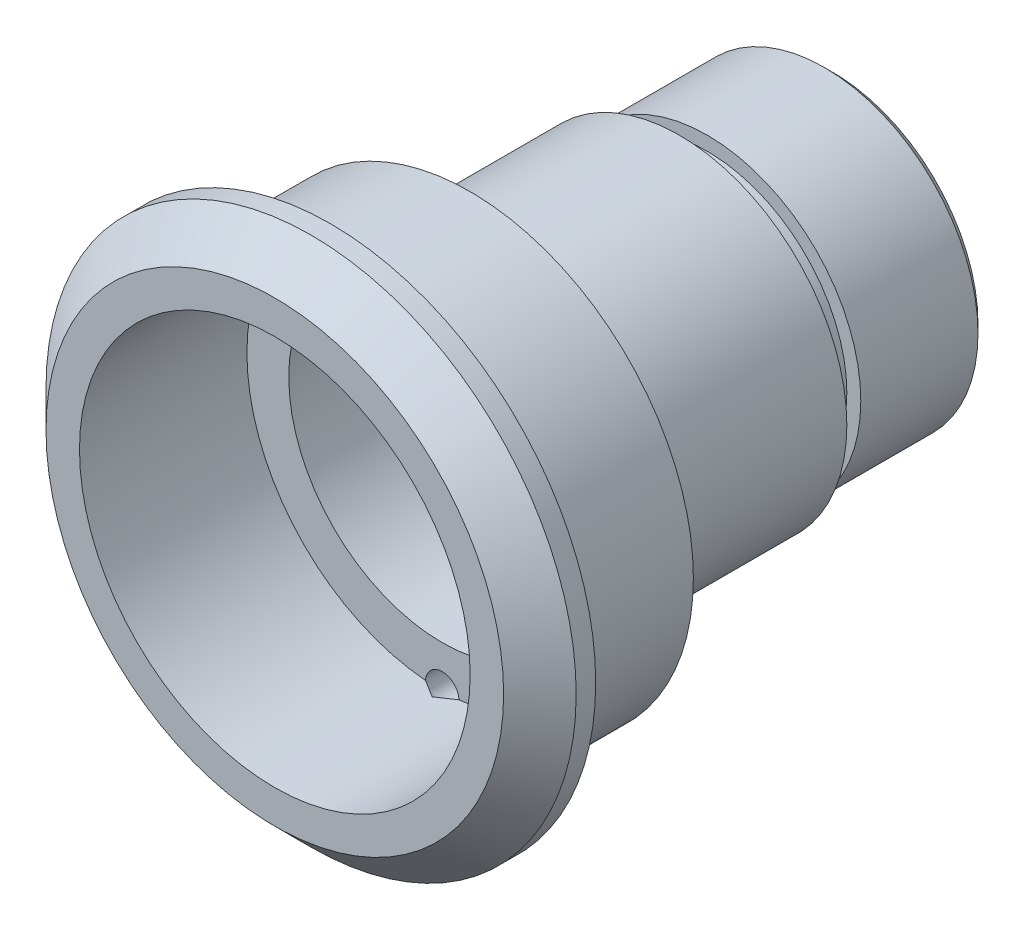
ISO-10303-21;
HEADER;
FILE_DESCRIPTION(('STEP AP214'),'2;1');
FILE_NAME('part.step','',(''),(''),'','','');
FILE_SCHEMA(('AUTOMOTIVE_DESIGN { 1 0 10303 214 1 1 1 1 }'));
ENDSEC;
DATA;
#1=APPLICATION_CONTEXT('core data for automotive mechanical design processes');
#2=APPLICATION_PROTOCOL_DEFINITION('international standard','automotive_design',2000,#1);
#3=PRODUCT_CONTEXT('',#1,'mechanical');
#4=PRODUCT('Part','Part','',(#3));
#5=PRODUCT_RELATED_PRODUCT_CATEGORY('part','',(#4));
#6=PRODUCT_DEFINITION_FORMATION('','',#4);
#7=PRODUCT_DEFINITION_CONTEXT('part definition',#1,'design');
#8=PRODUCT_DEFINITION('design','',#6,#7);
#9=PRODUCT_DEFINITION_SHAPE('','',#8);
#10=(LENGTH_UNIT() NAMED_UNIT(*) SI_UNIT(.MILLI.,.METRE.));
#11=(NAMED_UNIT(*) PLANE_ANGLE_UNIT() SI_UNIT($,.RADIAN.));
#12=(NAMED_UNIT(*) SI_UNIT($,.STERADIAN.) SOLID_ANGLE_UNIT());
#13=UNCERTAINTY_MEASURE_WITH_UNIT(LENGTH_MEASURE(1.E-05),#10,'distance_accuracy_value','');
#14=(GEOMETRIC_REPRESENTATION_CONTEXT(3) GLOBAL_UNCERTAINTY_ASSIGNED_CONTEXT((#13)) GLOBAL_UNIT_ASSIGNED_CONTEXT((#10,
#11,#12)) REPRESENTATION_CONTEXT('',''));
#15=CARTESIAN_POINT('',(0.,0.,0.));
#16=DIRECTION('',(0.,0.,1.));
#17=DIRECTION('',(1.,0.,0.));
#18=AXIS2_PLACEMENT_3D('',#15,#16,#17);
#19=CARTESIAN_POINT('',(0.,0.,-7.));
#20=DIRECTION('',(0.,0.,1.));
#21=DIRECTION('',(1.,0.,0.));
#22=AXIS2_PLACEMENT_3D('',#19,#20,#21);
#23=PLANE('',#22);
#24=CARTESIAN_POINT('',(0.,0.,-7.));
#25=DIRECTION('',(0.,0.,1.));
#26=DIRECTION('',(1.,0.,0.));
#27=AXIS2_PLACEMENT_3D('',#24,#25,#26);
#28=CIRCLE('',#27,8.);
#29=CARTESIAN_POINT('',(8.,0.,-7.));
#30=VERTEX_POINT('',#29);
#31=EDGE_CURVE('E173',#30,#30,#28,.F.);
#32=ORIENTED_EDGE('',*,*,#31,.T.);
#33=EDGE_LOOP('',(#32));
#34=FACE_BOUND('',#33,.T.);
#35=CARTESIAN_POINT('',(0.,-7.,-7.));
#36=DIRECTION('',(0.,0.,-1.));
#37=DIRECTION('',(-1.,0.,0.));
#38=AXIS2_PLACEMENT_3D('',#35,#36,#37);
#39=CIRCLE('',#38,0.599999999999989);
#40=CARTESIAN_POINT('',(0.499712046826593,-6.66790382378539,-7.));
#41=VERTEX_POINT('',#40);
#42=CARTESIAN_POINT('',(-0.49971204682659,-6.66790382378539,-7.));
#43=VERTEX_POINT('',#42);
#44=EDGE_CURVE('E76',#41,#43,#39,.T.);
#45=ORIENTED_EDGE('',*,*,#44,.F.);
#46=CARTESIAN_POINT('',(0.,0.,-7.));
#47=DIRECTION('',(0.,0.,1.));
#48=DIRECTION('',(1.,0.,0.));
#49=AXIS2_PLACEMENT_3D('',#46,#47,#48);
#50=CIRCLE('',#49,6.68660254037844);
#51=CARTESIAN_POINT('',(0.49971204682659,6.66790382378539,-7.));
#52=VERTEX_POINT('',#51);
#53=EDGE_CURVE('E157',#41,#52,#50,.T.);
#54=ORIENTED_EDGE('',*,*,#53,.T.);
#55=CARTESIAN_POINT('',(0.,7.,-7.));
#56=DIRECTION('',(0.,0.,-1.));
#57=DIRECTION('',(-1.,0.,0.));
#58=AXIS2_PLACEMENT_3D('',#55,#56,#57);
#59=CIRCLE('',#58,0.599999999999989);
#60=CARTESIAN_POINT('',(-0.499712046826593,6.66790382378539,-7.));
#61=VERTEX_POINT('',#60);
#62=EDGE_CURVE('E118',#61,#52,#59,.T.);
#63=ORIENTED_EDGE('',*,*,#62,.F.);
#64=EDGE_CURVE('E162',#61,#43,#50,.T.);
#65=ORIENTED_EDGE('',*,*,#64,.T.);
#66=EDGE_LOOP('',(#45,#54,#63,#65));
#67=FACE_BOUND('',#66,.T.);
#68=ADVANCED_FACE('F57',(#34,#67),#23,.F.);
#69=CARTESIAN_POINT('',(0.,0.,-20.));
#70=DIRECTION('',(0.,0.,1.));
#71=DIRECTION('',(1.,0.,0.));
#72=AXIS2_PLACEMENT_3D('',#69,#70,#71);
#73=CYLINDRICAL_SURFACE('',#72,4.05);
#74=CARTESIAN_POINT('',(0.,0.,-14.7));
#75=DIRECTION('',(0.,0.,1.));
#76=DIRECTION('',(1.,0.,0.));
#77=AXIS2_PLACEMENT_3D('',#74,#75,#76);
#78=CIRCLE('',#77,4.05);
#79=CARTESIAN_POINT('',(4.05,0.,-14.7));
#80=VERTEX_POINT('',#79);
#81=EDGE_CURVE('E192',#80,#80,#78,.T.);
#82=ORIENTED_EDGE('',*,*,#81,.T.);
#83=EDGE_LOOP('',(#82));
#84=FACE_BOUND('',#83,.T.);
#85=CARTESIAN_POINT('',(0.,0.,-15.3));
#86=DIRECTION('',(0.,0.,1.));
#87=DIRECTION('',(1.,0.,0.));
#88=AXIS2_PLACEMENT_3D('',#85,#86,#87);
#89=CIRCLE('',#88,4.05);
#90=CARTESIAN_POINT('',(4.05,0.,-15.3));
#91=VERTEX_POINT('',#90);
#92=EDGE_CURVE('E144',#91,#91,#89,.F.);
#93=ORIENTED_EDGE('',*,*,#92,.T.);
#94=EDGE_LOOP('',(#93));
#95=FACE_BOUND('',#94,.T.);
#96=ADVANCED_FACE('F255',(#84,#95),#73,.F.);
#97=CARTESIAN_POINT('',(0.,0.,31.1224482097295));
#98=DIRECTION('',(0.,0.,-1.));
#99=DIRECTION('',(-1.,0.,0.));
#100=AXIS2_PLACEMENT_3D('',#97,#98,#99);
#101=CYLINDRICAL_SURFACE('',#100,6.);
#102=CARTESIAN_POINT('',(0.,0.,-14.5));
#103=DIRECTION('',(0.,0.,1.));
#104=DIRECTION('',(1.,0.,0.));
#105=AXIS2_PLACEMENT_3D('',#102,#103,#104);
#106=CIRCLE('',#105,6.);
#107=CARTESIAN_POINT('',(6.,0.,-14.5));
#108=VERTEX_POINT('',#107);
#109=EDGE_CURVE('E168',#108,#108,#106,.F.);
#110=ORIENTED_EDGE('',*,*,#109,.F.);
#111=EDGE_LOOP('',(#110));
#112=FACE_BOUND('',#111,.T.);
#113=CARTESIAN_POINT('',(0.,0.,-6.95));
#114=DIRECTION('',(0.,0.,1.));
#115=DIRECTION('',(1.,0.,0.));
#116=AXIS2_PLACEMENT_3D('',#113,#114,#115);
#117=CIRCLE('',#116,6.);
#118=CARTESIAN_POINT('',(6.,0.,-6.95));
#119=VERTEX_POINT('',#118);
#120=EDGE_CURVE('E148',#119,#119,#117,.T.);
#121=ORIENTED_EDGE('',*,*,#120,.F.);
#122=EDGE_LOOP('',(#121));
#123=FACE_BOUND('',#122,.T.);
#124=ADVANCED_FACE('F261',(#112,#123),#101,.T.);
#125=CARTESIAN_POINT('',(0.,0.,-14.5));
#126=DIRECTION('',(0.,0.,1.));
#127=DIRECTION('',(1.,0.,0.));
#128=AXIS2_PLACEMENT_3D('',#125,#126,#127);
#129=PLANE('',#128);
#130=ORIENTED_EDGE('',*,*,#109,.T.);
#131=EDGE_LOOP('',(#130));
#132=FACE_BOUND('',#131,.T.);
#133=CARTESIAN_POINT('',(0.,0.,-14.5));
#134=DIRECTION('',(0.,0.,1.));
#135=DIRECTION('',(1.,0.,0.));
#136=AXIS2_PLACEMENT_3D('',#133,#134,#135);
#137=CIRCLE('',#136,5.);
#138=CARTESIAN_POINT('',(5.,0.,-14.5));
#139=VERTEX_POINT('',#138);
#140=EDGE_CURVE('E165',#139,#139,#137,.T.);
#141=ORIENTED_EDGE('',*,*,#140,.T.);
#142=EDGE_LOOP('',(#141));
#143=FACE_BOUND('',#142,.T.);
#144=ADVANCED_FACE('F457',(#132,#143),#129,.F.);
#145=CARTESIAN_POINT('',(0.,0.,0.));
#146=DIRECTION('',(0.,0.,1.));
#147=DIRECTION('',(1.,0.,0.));
#148=AXIS2_PLACEMENT_3D('',#145,#146,#147);
#149=CYLINDRICAL_SURFACE('',#148,5.);
#150=CARTESIAN_POINT('',(0.,0.,-15.5));
#151=DIRECTION('',(0.,0.,1.));
#152=DIRECTION('',(1.,0.,0.));
#153=AXIS2_PLACEMENT_3D('',#150,#151,#152);
#154=CIRCLE('',#153,5.);
#155=CARTESIAN_POINT('',(5.,0.,-15.5));
#156=VERTEX_POINT('',#155);
#157=EDGE_CURVE('E161',#156,#156,#154,.T.);
#158=ORIENTED_EDGE('',*,*,#157,.T.);
#159=EDGE_LOOP('',(#158));
#160=FACE_BOUND('',#159,.T.);
#161=ORIENTED_EDGE('',*,*,#140,.F.);
#162=EDGE_LOOP('',(#161));
#163=FACE_BOUND('',#162,.T.);
#164=ADVANCED_FACE('F473',(#160,#163),#149,.T.);
#165=CARTESIAN_POINT('',(0.,5.5,-15.5));
#166=DIRECTION('',(0.,0.,1.));
#167=DIRECTION('',(1.,0.,0.));
#168=AXIS2_PLACEMENT_3D('',#165,#166,#167);
#169=PLANE('',#168);
#170=CARTESIAN_POINT('',(0.,0.,-15.5));
#171=DIRECTION('',(0.,0.,1.));
#172=DIRECTION('',(1.,0.,0.));
#173=AXIS2_PLACEMENT_3D('',#170,#171,#172);
#174=CIRCLE('',#173,5.5);
#175=CARTESIAN_POINT('',(5.5,0.,-15.5));
#176=VERTEX_POINT('',#175);
#177=EDGE_CURVE('E158',#176,#176,#174,.T.);
#178=ORIENTED_EDGE('',*,*,#177,.T.);
#179=EDGE_LOOP('',(#178));
#180=FACE_BOUND('',#179,.T.);
#181=ORIENTED_EDGE('',*,*,#157,.F.);
#182=EDGE_LOOP('',(#181));
#183=FACE_BOUND('',#182,.T.);
#184=ADVANCED_FACE('F282',(#180,#183),#169,.T.);
#185=CARTESIAN_POINT('',(0.,0.,-20.));
#186=DIRECTION('',(0.,0.,1.));
#187=DIRECTION('',(1.,0.,0.));
#188=AXIS2_PLACEMENT_3D('',#185,#186,#187);
#189=PLANE('',#188);
#190=CARTESIAN_POINT('',(0.,0.,-20.));
#191=DIRECTION('',(0.,0.,-1.));
#192=DIRECTION('',(-1.,0.,0.));
#193=AXIS2_PLACEMENT_3D('',#190,#191,#192);
#194=CIRCLE('',#193,4.5);
#195=CARTESIAN_POINT('',(-4.5,0.,-20.));
#196=VERTEX_POINT('',#195);
#197=EDGE_CURVE('E149',#196,#196,#194,.T.);
#198=ORIENTED_EDGE('',*,*,#197,.F.);
#199=EDGE_LOOP('',(#198));
#200=FACE_BOUND('',#199,.T.);
#201=CARTESIAN_POINT('',(0.,0.,-20.));
#202=DIRECTION('',(0.,0.,1.));
#203=DIRECTION('',(1.,0.,0.));
#204=AXIS2_PLACEMENT_3D('',#201,#202,#203);
#205=CIRCLE('',#204,5.2);
#206=CARTESIAN_POINT('',(5.2,0.,-20.));
#207=VERTEX_POINT('',#206);
#208=EDGE_CURVE('E176',#207,#207,#205,.F.);
#209=ORIENTED_EDGE('',*,*,#208,.T.);
#210=EDGE_LOOP('',(#209));
#211=FACE_BOUND('',#210,.T.);
#212=ADVANCED_FACE('F278',(#200,#211),#189,.F.);
#213=CARTESIAN_POINT('',(0.,0.,21.1360399199047));
#214=DIRECTION('',(0.,0.,-1.));
#215=DIRECTION('',(-1.,0.,0.));
#216=AXIS2_PLACEMENT_3D('',#213,#214,#215);
#217=CYLINDRICAL_SURFACE('',#216,5.5);
#218=CARTESIAN_POINT('',(0.,0.,-19.7));
#219=DIRECTION('',(0.,0.,1.));
#220=DIRECTION('',(1.,0.,0.));
#221=AXIS2_PLACEMENT_3D('',#218,#219,#220);
#222=CIRCLE('',#221,5.5);
#223=CARTESIAN_POINT('',(5.5,0.,-19.7));
#224=VERTEX_POINT('',#223);
#225=EDGE_CURVE('E183',#224,#224,#222,.T.);
#226=ORIENTED_EDGE('',*,*,#225,.T.);
#227=EDGE_LOOP('',(#226));
#228=FACE_BOUND('',#227,.T.);
#229=ORIENTED_EDGE('',*,*,#177,.F.);
#230=EDGE_LOOP('',(#229));
#231=FACE_BOUND('',#230,.T.);
#232=ADVANCED_FACE('F281',(#228,#231),#217,.T.);
#233=CARTESIAN_POINT('',(0.,0.,-20.));
#234=DIRECTION('',(0.,0.,1.));
#235=DIRECTION('',(1.,0.,0.));
#236=AXIS2_PLACEMENT_3D('',#233,#234,#235);
#237=CONICAL_SURFACE('',#236,5.2,0.78539816339744);
#238=ORIENTED_EDGE('',*,*,#225,.F.);
#239=EDGE_LOOP('',(#238));
#240=FACE_BOUND('',#239,.T.);
#241=ORIENTED_EDGE('',*,*,#208,.F.);
#242=EDGE_LOOP('',(#241));
#243=FACE_BOUND('',#242,.T.);
#244=ADVANCED_FACE('F293',(#240,#243),#237,.T.);
#245=CARTESIAN_POINT('',(0.,0.,-6.77679491924311));
#246=DIRECTION('',(0.,0.,-1.));
#247=DIRECTION('',(-1.,0.,0.));
#248=AXIS2_PLACEMENT_3D('',#245,#246,#247);
#249=CONICAL_SURFACE('',#248,6.3,1.04719755119659);
#250=CARTESIAN_POINT('',(0.,0.,-6.77679491924311));
#251=DIRECTION('',(0.,0.,1.));
#252=DIRECTION('',(1.,0.,0.));
#253=AXIS2_PLACEMENT_3D('',#250,#251,#252);
#254=CIRCLE('',#253,6.3);
#255=CARTESIAN_POINT('',(6.3,0.,-6.77679491924311));
#256=VERTEX_POINT('',#255);
#257=EDGE_CURVE('E154',#256,#256,#254,.T.);
#258=ORIENTED_EDGE('',*,*,#257,.T.);
#259=EDGE_LOOP('',(#258));
#260=FACE_BOUND('',#259,.T.);
#261=ORIENTED_EDGE('',*,*,#53,.F.);
#262=CARTESIAN_POINT('',(0.499931803204619,-6.66823473336625,-7.0002));
#263=CARTESIAN_POINT('',(0.481868871640982,-6.64098917877085,-6.98373710964591));
#264=CARTESIAN_POINT('',(0.46134061995718,-6.6149179000884,-6.96787100584774));
#265=CARTESIAN_POINT('',(0.415486066946909,-6.56582941066476,-6.93783310115662));
#266=CARTESIAN_POINT('',(0.39012529686623,-6.54283629453614,-6.92367474442129));
#267=CARTESIAN_POINT('',(0.334893479556244,-6.50094835648245,-6.89775864719696));
#268=CARTESIAN_POINT('',(0.305003020703138,-6.48207206977728,-6.8860117773339));
#269=CARTESIAN_POINT('',(0.241566147061567,-6.44962919975067,-6.86575164458902));
#270=CARTESIAN_POINT('',(0.208032130434367,-6.43604528920643,-6.85722783217549));
#271=CARTESIAN_POINT('',(0.142547018702538,-6.41629927479261,-6.84481288119898));
#272=CARTESIAN_POINT('',(0.110887598519857,-6.40944297763231,-6.84048907141598));
#273=CARTESIAN_POINT('',(0.0465919619470222,-6.40093515438383,-6.83512146778807));
#274=CARTESIAN_POINT('',(0.0139559167056153,-6.39928272167395,-6.8340771025956));
#275=CARTESIAN_POINT('',(-0.0475402773049551,-6.40118232283446,-6.83527645712868));
#276=CARTESIAN_POINT('',(-0.0764262030368063,-6.40418955313425,-6.83717598469158));
#277=CARTESIAN_POINT('',(-0.133181626885946,-6.41425868846028,-6.84352437752356));
#278=CARTESIAN_POINT('',(-0.161051352670028,-6.42131967928247,-6.84797266799518));
#279=CARTESIAN_POINT('',(-0.215168582467526,-6.43918105578991,-6.85919379099335));
#280=CARTESIAN_POINT('',(-0.241410101092658,-6.44999437422474,-6.865974662267));
#281=CARTESIAN_POINT('',(-0.291647128680451,-6.47490098404804,-6.8815373399178));
#282=CARTESIAN_POINT('',(-0.315641377798312,-6.48899609999757,-6.8903202593043));
#283=CARTESIAN_POINT('',(-0.363287394640745,-6.52152761112996,-6.91050584073616));
#284=CARTESIAN_POINT('',(-0.386664007044726,-6.54025746795904,-6.92208280936149));
#285=CARTESIAN_POINT('',(-0.429941710925007,-6.58045014533174,-6.9467951117563));
#286=CARTESIAN_POINT('',(-0.449844462140309,-6.60191165222702,-6.95992969626356));
#287=CARTESIAN_POINT('',(-0.479325792853137,-6.6386434752432,-6.98228398441422));
#288=CARTESIAN_POINT('',(-0.489997114067349,-6.65326092447222,-6.991150758366));
#289=CARTESIAN_POINT('',(-0.499931803204624,-6.66823473336625,-7.0002));
#290=B_SPLINE_CURVE_WITH_KNOTS('',3,(#262,#263,#264,#265,#266,#267,#268,#269,#270,#271,#272,
#273,#274,#275,#276,#277,#278,#279,#280,#281,#282,#283,#284,#285,#286,#287,#288,#289),
.UNSPECIFIED.,.F.,.F.,(4,2,2,2,2,2,2,2,2,2,2,2,2,4),(0.,0.109813049369391,0.220440848941089,
0.331556891855849,0.442306021148065,0.539786934900109,0.63725086450438,0.724148569795621,
0.811026685610627,0.898207258910785,0.985436417693035,1.08140484522836,1.17732729477037,
1.23770379450551),.UNSPECIFIED.);
#291=EDGE_CURVE('E15',#41,#43,#290,.T.);
#292=ORIENTED_EDGE('',*,*,#291,.T.);
#293=ORIENTED_EDGE('',*,*,#64,.F.);
#294=CARTESIAN_POINT('',(-0.499931803204619,6.66823473336625,-7.0002));
#295=CARTESIAN_POINT('',(-0.481868871640982,6.64098917877085,-6.98373710964591));
#296=CARTESIAN_POINT('',(-0.46134061995718,6.6149179000884,-6.96787100584774));
#297=CARTESIAN_POINT('',(-0.415486066946909,6.56582941066476,-6.93783310115662));
#298=CARTESIAN_POINT('',(-0.39012529686623,6.54283629453614,-6.92367474442129));
#299=CARTESIAN_POINT('',(-0.334893479556244,6.50094835648245,-6.89775864719696));
#300=CARTESIAN_POINT('',(-0.305003020703138,6.48207206977728,-6.8860117773339));
#301=CARTESIAN_POINT('',(-0.241566147061567,6.44962919975067,-6.86575164458902));
#302=CARTESIAN_POINT('',(-0.208032130434367,6.43604528920643,-6.85722783217549));
#303=CARTESIAN_POINT('',(-0.142547018702538,6.41629927479261,-6.84481288119898));
#304=CARTESIAN_POINT('',(-0.110887598519857,6.40944297763231,-6.84048907141598));
#305=CARTESIAN_POINT('',(-0.0465919619470222,6.40093515438383,-6.83512146778807));
#306=CARTESIAN_POINT('',(-0.0139559167056153,6.39928272167395,-6.8340771025956));
#307=CARTESIAN_POINT('',(0.0475402773049551,6.40118232283446,-6.83527645712868));
#308=CARTESIAN_POINT('',(0.0764262030368063,6.40418955313425,-6.83717598469158));
#309=CARTESIAN_POINT('',(0.133181626885946,6.41425868846028,-6.84352437752356));
#310=CARTESIAN_POINT('',(0.161051352670028,6.42131967928247,-6.84797266799518));
#311=CARTESIAN_POINT('',(0.215168582467526,6.43918105578991,-6.85919379099335));
#312=CARTESIAN_POINT('',(0.241410101092658,6.44999437422474,-6.865974662267));
#313=CARTESIAN_POINT('',(0.291647128680451,6.47490098404804,-6.8815373399178));
#314=CARTESIAN_POINT('',(0.315641377798312,6.48899609999757,-6.8903202593043));
#315=CARTESIAN_POINT('',(0.363287394640745,6.52152761112996,-6.91050584073616));
#316=CARTESIAN_POINT('',(0.386664007044726,6.54025746795904,-6.92208280936149));
#317=CARTESIAN_POINT('',(0.429941710925007,6.58045014533174,-6.9467951117563));
#318=CARTESIAN_POINT('',(0.449844462140309,6.60191165222702,-6.95992969626356));
#319=CARTESIAN_POINT('',(0.479325792853137,6.6386434752432,-6.98228398441422));
#320=CARTESIAN_POINT('',(0.489997114067349,6.65326092447222,-6.991150758366));
#321=CARTESIAN_POINT('',(0.499931803204624,6.66823473336625,-7.0002));
#322=B_SPLINE_CURVE_WITH_KNOTS('',3,(#294,#295,#296,#297,#298,#299,#300,#301,#302,#303,#304,
#305,#306,#307,#308,#309,#310,#311,#312,#313,#314,#315,#316,#317,#318,#319,#320,#321),
.UNSPECIFIED.,.F.,.F.,(4,2,2,2,2,2,2,2,2,2,2,2,2,4),(0.,0.109813049369391,0.220440848941089,
0.331556891855849,0.442306021148065,0.539786934900109,0.63725086450438,0.724148569795621,
0.811026685610627,0.898207258910785,0.985436417693035,1.08140484522836,1.17732729477037,
1.23770379450551),.UNSPECIFIED.);
#323=EDGE_CURVE('E231',#61,#52,#322,.T.);
#324=ORIENTED_EDGE('',*,*,#323,.T.);
#325=EDGE_LOOP('',(#261,#292,#293,#324));
#326=FACE_BOUND('',#325,.T.);
#327=ADVANCED_FACE('F295',(#260,#326),#249,.F.);
#328=CARTESIAN_POINT('',(0.,0.,-6.95));
#329=DIRECTION('',(0.,0.,1.));
#330=DIRECTION('',(1.,0.,0.));
#331=AXIS2_PLACEMENT_3D('',#328,#329,#330);
#332=TOROIDAL_SURFACE('',#331,6.2,0.2);
#333=ORIENTED_EDGE('',*,*,#257,.F.);
#334=EDGE_LOOP('',(#333));
#335=FACE_BOUND('',#334,.T.);
#336=ORIENTED_EDGE('',*,*,#120,.T.);
#337=EDGE_LOOP('',(#336));
#338=FACE_BOUND('',#337,.T.);
#339=ADVANCED_FACE('F288',(#335,#338),#332,.F.);
#340=CARTESIAN_POINT('',(0.,0.,0.));
#341=DIRECTION('',(0.,0.,1.));
#342=DIRECTION('',(1.,0.,0.));
#343=AXIS2_PLACEMENT_3D('',#340,#341,#342);
#344=PLANE('',#343);
#345=CARTESIAN_POINT('',(0.,0.,0.));
#346=DIRECTION('',(0.,0.,1.));
#347=DIRECTION('',(1.,0.,0.));
#348=AXIS2_PLACEMENT_3D('',#345,#346,#347);
#349=CIRCLE('',#348,7.);
#350=CARTESIAN_POINT('',(7.,0.,0.));
#351=VERTEX_POINT('',#350);
#352=EDGE_CURVE('E131',#351,#351,#349,.T.);
#353=ORIENTED_EDGE('',*,*,#352,.F.);
#354=EDGE_LOOP('',(#353));
#355=FACE_BOUND('',#354,.T.);
#356=CARTESIAN_POINT('',(0.,0.,0.));
#357=DIRECTION('',(0.,0.,1.));
#358=DIRECTION('',(1.,0.,0.));
#359=AXIS2_PLACEMENT_3D('',#356,#357,#358);
#360=CIRCLE('',#359,8.20000000000001);
#361=CARTESIAN_POINT('',(8.20000000000001,0.,0.));
#362=VERTEX_POINT('',#361);
#363=EDGE_CURVE('E186',#362,#362,#360,.T.);
#364=ORIENTED_EDGE('',*,*,#363,.T.);
#365=EDGE_LOOP('',(#364));
#366=FACE_BOUND('',#365,.T.);
#367=ADVANCED_FACE('F284',(#355,#366),#344,.T.);
#368=CARTESIAN_POINT('',(0.,0.,0.));
#369=DIRECTION('',(0.,0.,-1.));
#370=DIRECTION('',(-1.,0.,0.));
#371=AXIS2_PLACEMENT_3D('',#368,#369,#370);
#372=CONICAL_SURFACE('',#371,8.20000000000001,0.785398163397446);
#373=CARTESIAN_POINT('',(0.,0.,-1.3));
#374=DIRECTION('',(0.,0.,1.));
#375=DIRECTION('',(1.,0.,0.));
#376=AXIS2_PLACEMENT_3D('',#373,#374,#375);
#377=CIRCLE('',#376,9.5);
#378=CARTESIAN_POINT('',(9.5,0.,-1.3));
#379=VERTEX_POINT('',#378);
#380=EDGE_CURVE('E189',#379,#379,#377,.F.);
#381=ORIENTED_EDGE('',*,*,#380,.F.);
#382=EDGE_LOOP('',(#381));
#383=FACE_BOUND('',#382,.T.);
#384=ORIENTED_EDGE('',*,*,#363,.F.);
#385=EDGE_LOOP('',(#384));
#386=FACE_BOUND('',#385,.T.);
#387=ADVANCED_FACE('F287',(#383,#386),#372,.T.);
#388=CARTESIAN_POINT('',(0.,0.,-20.));
#389=DIRECTION('',(0.,0.,1.));
#390=DIRECTION('',(1.,0.,0.));
#391=AXIS2_PLACEMENT_3D('',#388,#389,#390);
#392=CYLINDRICAL_SURFACE('',#391,9.5);
#393=ORIENTED_EDGE('',*,*,#380,.T.);
#394=EDGE_LOOP('',(#393));
#395=FACE_BOUND('',#394,.T.);
#396=CARTESIAN_POINT('',(0.,0.,-2.));
#397=DIRECTION('',(0.,0.,1.));
#398=DIRECTION('',(1.,0.,0.));
#399=AXIS2_PLACEMENT_3D('',#396,#397,#398);
#400=CIRCLE('',#399,9.5);
#401=CARTESIAN_POINT('',(9.5,0.,-2.));
#402=VERTEX_POINT('',#401);
#403=EDGE_CURVE('E172',#402,#402,#400,.F.);
#404=ORIENTED_EDGE('',*,*,#403,.F.);
#405=EDGE_LOOP('',(#404));
#406=FACE_BOUND('',#405,.T.);
#407=ADVANCED_FACE('F276',(#395,#406),#392,.T.);
#408=CARTESIAN_POINT('',(0.,0.,-2.));
#409=DIRECTION('',(0.,0.,1.));
#410=DIRECTION('',(1.,0.,0.));
#411=AXIS2_PLACEMENT_3D('',#408,#409,#410);
#412=PLANE('',#411);
#413=ORIENTED_EDGE('',*,*,#403,.T.);
#414=EDGE_LOOP('',(#413));
#415=FACE_BOUND('',#414,.T.);
#416=CARTESIAN_POINT('',(0.,0.,-2.));
#417=DIRECTION('',(0.,0.,1.));
#418=DIRECTION('',(1.,0.,0.));
#419=AXIS2_PLACEMENT_3D('',#416,#417,#418);
#420=CIRCLE('',#419,8.);
#421=CARTESIAN_POINT('',(8.,0.,-2.));
#422=VERTEX_POINT('',#421);
#423=EDGE_CURVE('E169',#422,#422,#420,.F.);
#424=ORIENTED_EDGE('',*,*,#423,.F.);
#425=EDGE_LOOP('',(#424));
#426=FACE_BOUND('',#425,.T.);
#427=ADVANCED_FACE('F272',(#415,#426),#412,.F.);
#428=CARTESIAN_POINT('',(0.,0.,33.1224482097295));
#429=DIRECTION('',(0.,0.,-1.));
#430=DIRECTION('',(-1.,0.,0.));
#431=AXIS2_PLACEMENT_3D('',#428,#429,#430);
#432=CYLINDRICAL_SURFACE('',#431,8.);
#433=ORIENTED_EDGE('',*,*,#31,.F.);
#434=EDGE_LOOP('',(#433));
#435=FACE_BOUND('',#434,.T.);
#436=ORIENTED_EDGE('',*,*,#423,.T.);
#437=EDGE_LOOP('',(#436));
#438=FACE_BOUND('',#437,.T.);
#439=ADVANCED_FACE('F268',(#435,#438),#432,.T.);
#440=CARTESIAN_POINT('',(0.,0.,-15.5));
#441=DIRECTION('',(0.,0.,-1.));
#442=DIRECTION('',(-1.,0.,0.));
#443=AXIS2_PLACEMENT_3D('',#440,#441,#442);
#444=PLANE('',#443);
#445=CARTESIAN_POINT('',(0.,0.,-15.5));
#446=DIRECTION('',(0.,0.,-1.));
#447=DIRECTION('',(-1.,0.,0.));
#448=AXIS2_PLACEMENT_3D('',#445,#446,#447);
#449=CIRCLE('',#448,4.45);
#450=CARTESIAN_POINT('',(-4.45,0.,-15.5));
#451=VERTEX_POINT('',#450);
#452=EDGE_CURVE('E133',#451,#451,#449,.T.);
#453=ORIENTED_EDGE('',*,*,#452,.F.);
#454=EDGE_LOOP('',(#453));
#455=FACE_BOUND('',#454,.T.);
#456=CARTESIAN_POINT('',(0.,0.,-15.5));
#457=DIRECTION('',(0.,0.,-1.));
#458=DIRECTION('',(-1.,0.,0.));
#459=AXIS2_PLACEMENT_3D('',#456,#457,#458);
#460=CIRCLE('',#459,4.5);
#461=CARTESIAN_POINT('',(-4.5,0.,-15.5));
#462=VERTEX_POINT('',#461);
#463=EDGE_CURVE('E145',#462,#462,#460,.T.);
#464=ORIENTED_EDGE('',*,*,#463,.T.);
#465=EDGE_LOOP('',(#464));
#466=FACE_BOUND('',#465,.T.);
#467=ADVANCED_FACE('F271',(#455,#466),#444,.T.);
#468=CARTESIAN_POINT('',(0.,0.,-15.5));
#469=DIRECTION('',(0.,0.,-1.));
#470=DIRECTION('',(-1.,0.,0.));
#471=AXIS2_PLACEMENT_3D('',#468,#469,#470);
#472=CYLINDRICAL_SURFACE('',#471,4.5);
#473=ORIENTED_EDGE('',*,*,#463,.F.);
#474=EDGE_LOOP('',(#473));
#475=FACE_BOUND('',#474,.T.);
#476=ORIENTED_EDGE('',*,*,#197,.T.);
#477=EDGE_LOOP('',(#476));
#478=FACE_BOUND('',#477,.T.);
#479=ADVANCED_FACE('F334',(#475,#478),#472,.F.);
#480=CARTESIAN_POINT('',(0.,0.,-15.3));
#481=DIRECTION('',(0.,0.,1.));
#482=DIRECTION('',(1.,0.,0.));
#483=AXIS2_PLACEMENT_3D('',#480,#481,#482);
#484=PLANE('',#483);
#485=CARTESIAN_POINT('',(0.,0.,-15.3));
#486=DIRECTION('',(0.,0.,1.));
#487=DIRECTION('',(1.,0.,0.));
#488=AXIS2_PLACEMENT_3D('',#485,#486,#487);
#489=CIRCLE('',#488,4.45);
#490=CARTESIAN_POINT('',(4.45,0.,-15.3));
#491=VERTEX_POINT('',#490);
#492=EDGE_CURVE('E141',#491,#491,#489,.F.);
#493=ORIENTED_EDGE('',*,*,#492,.T.);
#494=EDGE_LOOP('',(#493));
#495=FACE_BOUND('',#494,.T.);
#496=ORIENTED_EDGE('',*,*,#92,.F.);
#497=EDGE_LOOP('',(#496));
#498=FACE_BOUND('',#497,.T.);
#499=ADVANCED_FACE('F343',(#495,#498),#484,.F.);
#500=CARTESIAN_POINT('',(0.,0.,5.58650070512055));
#501=DIRECTION('',(0.,0.,-1.));
#502=DIRECTION('',(-1.,0.,0.));
#503=AXIS2_PLACEMENT_3D('',#500,#501,#502);
#504=CYLINDRICAL_SURFACE('',#503,4.45);
#505=ORIENTED_EDGE('',*,*,#452,.T.);
#506=EDGE_LOOP('',(#505));
#507=FACE_BOUND('',#506,.T.);
#508=ORIENTED_EDGE('',*,*,#492,.F.);
#509=EDGE_LOOP('',(#508));
#510=FACE_BOUND('',#509,.T.);
#511=ADVANCED_FACE('F221',(#507,#510),#504,.F.);
#512=CARTESIAN_POINT('',(0.,0.,-6.));
#513=DIRECTION('',(0.,0.,1.));
#514=DIRECTION('',(1.,0.,0.));
#515=AXIS2_PLACEMENT_3D('',#512,#513,#514);
#516=PLANE('',#515);
#517=CARTESIAN_POINT('',(0.,-7.,-6.));
#518=DIRECTION('',(0.,0.,-1.));
#519=DIRECTION('',(-1.,0.,0.));
#520=AXIS2_PLACEMENT_3D('',#517,#518,#519);
#521=CIRCLE('',#520,0.599999999999988);
#522=CARTESIAN_POINT('',(-0.599448726339618,-6.97428571428572,-6.));
#523=VERTEX_POINT('',#522);
#524=CARTESIAN_POINT('',(0.599448726339618,-6.97428571428572,-6.));
#525=VERTEX_POINT('',#524);
#526=EDGE_CURVE('E111',#523,#525,#521,.T.);
#527=ORIENTED_EDGE('',*,*,#526,.T.);
#528=CARTESIAN_POINT('',(0.,0.,-6.));
#529=DIRECTION('',(0.,0.,1.));
#530=DIRECTION('',(1.,0.,0.));
#531=AXIS2_PLACEMENT_3D('',#528,#529,#530);
#532=CIRCLE('',#531,7.);
#533=CARTESIAN_POINT('',(0.599448726339618,6.97428571428572,-6.));
#534=VERTEX_POINT('',#533);
#535=EDGE_CURVE('E130',#534,#525,#532,.F.);
#536=ORIENTED_EDGE('',*,*,#535,.F.);
#537=CARTESIAN_POINT('',(0.,7.,-6.));
#538=DIRECTION('',(0.,0.,-1.));
#539=DIRECTION('',(-1.,0.,0.));
#540=AXIS2_PLACEMENT_3D('',#537,#538,#539);
#541=CIRCLE('',#540,0.599999999999988);
#542=CARTESIAN_POINT('',(-0.599448726339618,6.97428571428572,-6.));
#543=VERTEX_POINT('',#542);
#544=EDGE_CURVE('E129',#534,#543,#541,.T.);
#545=ORIENTED_EDGE('',*,*,#544,.T.);
#546=EDGE_CURVE('E123',#523,#543,#532,.F.);
#547=ORIENTED_EDGE('',*,*,#546,.F.);
#548=EDGE_LOOP('',(#527,#536,#545,#547));
#549=FACE_BOUND('',#548,.T.);
#550=CARTESIAN_POINT('',(0.,0.,-6.));
#551=DIRECTION('',(0.,0.,1.));
#552=DIRECTION('',(1.,0.,0.));
#553=AXIS2_PLACEMENT_3D('',#550,#551,#552);
#554=CIRCLE('',#553,5.5);
#555=CARTESIAN_POINT('',(5.5,0.,-6.));
#556=VERTEX_POINT('',#555);
#557=EDGE_CURVE('E545',#556,#556,#554,.T.);
#558=ORIENTED_EDGE('',*,*,#557,.F.);
#559=EDGE_LOOP('',(#558));
#560=FACE_BOUND('',#559,.T.);
#561=ADVANCED_FACE('F126',(#549,#560),#516,.T.);
#562=CARTESIAN_POINT('',(0.,0.,-26.7989898732233));
#563=DIRECTION('',(0.,0.,1.));
#564=DIRECTION('',(1.,0.,0.));
#565=AXIS2_PLACEMENT_3D('',#562,#563,#564);
#566=CYLINDRICAL_SURFACE('',#565,7.);
#567=CARTESIAN_POINT('',(0.,-7.,-5.63948362858346));
#568=CARTESIAN_POINT('',(6.25412716124011E-06,-7.,-5.63948738644218));
#569=CARTESIAN_POINT('',(1.25082543225206E-05,-6.99999999999162,-5.6394911443009));
#570=CARTESIAN_POINT('',(7.5906868201058E-05,-6.9999999998217,-5.63952923803128));
#571=CARTESIAN_POINT('',(0.000133051354919401,-6.99999999896878,-5.63956357390293));
#572=CARTESIAN_POINT('',(0.000418773788601541,-6.99999999120543,-5.63973525326136));
#573=CARTESIAN_POINT('',(0.000647351735269958,-6.99999997379878,-5.63987259674821));
#574=CARTESIAN_POINT('',(0.00179024147621198,-6.99999983078601,-5.64055931418682));
#575=CARTESIAN_POINT('',(0.00270455325702316,-6.99999953724135,-5.64110868812989));
#576=CARTESIAN_POINT('',(0.00727611253001076,-6.99999717382547,-5.64385555829682));
#577=CARTESIAN_POINT('',(0.0109333588081511,-6.99999241687653,-5.64605305448095));
#578=CARTESIAN_POINT('',(0.0292196141896187,-6.99995430173386,-5.65704056323487));
#579=CARTESIAN_POINT('',(0.0438485467295228,-6.99987795234534,-5.6658305700553));
#580=CARTESIAN_POINT('',(0.116994741604248,-6.99926686523033,-5.70978238793734));
#581=CARTESIAN_POINT('',(0.175507091602507,-6.998044106927,-5.74494383698747));
#582=CARTESIAN_POINT('',(0.468167491085104,-6.98825584112023,-5.92086569827292));
#583=CARTESIAN_POINT('',(0.702000270329784,-6.96866690398047,-6.06160285545549));
#584=CARTESIAN_POINT('',(0.934486855358361,-6.93734346253394,-6.20224069143943));
#585=B_SPLINE_CURVE_WITH_KNOTS('',3,(#567,#568,#569,#570,#571,#572,#573,#574,#575,#576,#577,
#578,#579,#580,#581,#582,#583,#584),.UNSPECIFIED.,.F.,.F.,(4,2,2,2,2,2,2,2,4),(0.,
2.18888208501564E-05,0.000221888820861213,0.00102188882156652,0.00422188886669249,
0.0170218917547553,0.0682220765934159,0.273033908972941,1.09299396558168),.UNSPECIFIED.);
#586=CARTESIAN_POINT('',(0.,-7.,-5.63948362858346));
#587=VERTEX_POINT('',#586);
#588=EDGE_CURVE('E108',#525,#587,#585,.F.);
#589=ORIENTED_EDGE('',*,*,#588,.T.);
#590=CARTESIAN_POINT('',(0.,-7.,-5.63948362858346));
#591=CARTESIAN_POINT('',(-6.25412716124011E-06,-7.,-5.63948738644218));
#592=CARTESIAN_POINT('',(-1.25082543225206E-05,-6.99999999999162,-5.6394911443009));
#593=CARTESIAN_POINT('',(-7.5906868201058E-05,-6.9999999998217,-5.63952923803128));
#594=CARTESIAN_POINT('',(-0.000133051354919401,-6.99999999896878,-5.63956357390293));
#595=CARTESIAN_POINT('',(-0.000418773788601541,-6.99999999120543,-5.63973525326136));
#596=CARTESIAN_POINT('',(-0.000647351735269958,-6.99999997379878,-5.63987259674821));
#597=CARTESIAN_POINT('',(-0.00179024147621198,-6.99999983078601,-5.64055931418682));
#598=CARTESIAN_POINT('',(-0.00270455325702316,-6.99999953724135,-5.64110868812989));
#599=CARTESIAN_POINT('',(-0.00727611253001076,-6.99999717382547,-5.64385555829682));
#600=CARTESIAN_POINT('',(-0.0109333588081511,-6.99999241687653,-5.64605305448095));
#601=CARTESIAN_POINT('',(-0.0292196141896187,-6.99995430173386,-5.65704056323487));
#602=CARTESIAN_POINT('',(-0.0438485467295228,-6.99987795234534,-5.6658305700553));
#603=CARTESIAN_POINT('',(-0.116994741604248,-6.99926686523033,-5.70978238793734));
#604=CARTESIAN_POINT('',(-0.175507091602507,-6.998044106927,-5.74494383698747));
#605=CARTESIAN_POINT('',(-0.468167491085104,-6.98825584112023,-5.92086569827292));
#606=CARTESIAN_POINT('',(-0.702000270329784,-6.96866690398047,-6.06160285545549));
#607=CARTESIAN_POINT('',(-0.934486855358361,-6.93734346253394,-6.20224069143943));
#608=B_SPLINE_CURVE_WITH_KNOTS('',3,(#590,#591,#592,#593,#594,#595,#596,#597,#598,#599,#600,
#601,#602,#603,#604,#605,#606,#607),.UNSPECIFIED.,.F.,.F.,(4,2,2,2,2,2,2,2,4),(0.,
2.18888208501564E-05,0.000221888820861213,0.00102188882156652,0.00422188886669249,
0.0170218917547553,0.0682220765934159,0.273033908972941,1.09299396558168),.UNSPECIFIED.);
#609=EDGE_CURVE('E70',#587,#523,#608,.T.);
#610=ORIENTED_EDGE('',*,*,#609,.T.);
#611=ORIENTED_EDGE('',*,*,#546,.T.);
#612=CARTESIAN_POINT('',(0.,7.,-5.63948362858346));
#613=CARTESIAN_POINT('',(-6.25412716124011E-06,7.,-5.63948738644218));
#614=CARTESIAN_POINT('',(-1.25082543225206E-05,6.99999999999162,-5.6394911443009));
#615=CARTESIAN_POINT('',(-7.5906868201058E-05,6.9999999998217,-5.63952923803128));
#616=CARTESIAN_POINT('',(-0.000133051354919401,6.99999999896878,-5.63956357390293));
#617=CARTESIAN_POINT('',(-0.000418773788601541,6.99999999120543,-5.63973525326136));
#618=CARTESIAN_POINT('',(-0.000647351735269958,6.99999997379878,-5.63987259674821));
#619=CARTESIAN_POINT('',(-0.00179024147621198,6.99999983078601,-5.64055931418682));
#620=CARTESIAN_POINT('',(-0.00270455325702316,6.99999953724135,-5.64110868812989));
#621=CARTESIAN_POINT('',(-0.00727611253001076,6.99999717382547,-5.64385555829682));
#622=CARTESIAN_POINT('',(-0.0109333588081511,6.99999241687653,-5.64605305448095));
#623=CARTESIAN_POINT('',(-0.0292196141896187,6.99995430173386,-5.65704056323487));
#624=CARTESIAN_POINT('',(-0.0438485467295228,6.99987795234534,-5.6658305700553));
#625=CARTESIAN_POINT('',(-0.116994741604248,6.99926686523033,-5.70978238793734));
#626=CARTESIAN_POINT('',(-0.175507091602507,6.998044106927,-5.74494383698747));
#627=CARTESIAN_POINT('',(-0.468167491085104,6.98825584112023,-5.92086569827292));
#628=CARTESIAN_POINT('',(-0.702000270329784,6.96866690398047,-6.06160285545549));
#629=CARTESIAN_POINT('',(-0.934486855358361,6.93734346253394,-6.20224069143943));
#630=B_SPLINE_CURVE_WITH_KNOTS('',3,(#612,#613,#614,#615,#616,#617,#618,#619,#620,#621,#622,
#623,#624,#625,#626,#627,#628,#629),.UNSPECIFIED.,.F.,.F.,(4,2,2,2,2,2,2,2,4),(0.,
2.18888208501564E-05,0.000221888820861213,0.00102188882156652,0.00422188886669249,
0.0170218917547553,0.0682220765934159,0.273033908972941,1.09299396558168),.UNSPECIFIED.);
#631=CARTESIAN_POINT('',(0.,7.,-5.63948362858346));
#632=VERTEX_POINT('',#631);
#633=EDGE_CURVE('E199',#543,#632,#630,.F.);
#634=ORIENTED_EDGE('',*,*,#633,.T.);
#635=CARTESIAN_POINT('',(0.,7.,-5.63948362858346));
#636=CARTESIAN_POINT('',(6.25412716124011E-06,7.,-5.63948738644218));
#637=CARTESIAN_POINT('',(1.25082543225206E-05,6.99999999999162,-5.6394911443009));
#638=CARTESIAN_POINT('',(7.5906868201058E-05,6.9999999998217,-5.63952923803128));
#639=CARTESIAN_POINT('',(0.000133051354919401,6.99999999896878,-5.63956357390293));
#640=CARTESIAN_POINT('',(0.000418773788601541,6.99999999120543,-5.63973525326136));
#641=CARTESIAN_POINT('',(0.000647351735269958,6.99999997379878,-5.63987259674821));
#642=CARTESIAN_POINT('',(0.00179024147621198,6.99999983078601,-5.64055931418682));
#643=CARTESIAN_POINT('',(0.00270455325702316,6.99999953724135,-5.64110868812989));
#644=CARTESIAN_POINT('',(0.00727611253001076,6.99999717382547,-5.64385555829682));
#645=CARTESIAN_POINT('',(0.0109333588081511,6.99999241687653,-5.64605305448095));
#646=CARTESIAN_POINT('',(0.0292196141896187,6.99995430173386,-5.65704056323487));
#647=CARTESIAN_POINT('',(0.0438485467295228,6.99987795234534,-5.6658305700553));
#648=CARTESIAN_POINT('',(0.116994741604248,6.99926686523033,-5.70978238793734));
#649=CARTESIAN_POINT('',(0.175507091602507,6.998044106927,-5.74494383698747));
#650=CARTESIAN_POINT('',(0.468167491085104,6.98825584112023,-5.92086569827292));
#651=CARTESIAN_POINT('',(0.702000270329784,6.96866690398047,-6.06160285545549));
#652=CARTESIAN_POINT('',(0.934486855358361,6.93734346253394,-6.20224069143943));
#653=B_SPLINE_CURVE_WITH_KNOTS('',3,(#635,#636,#637,#638,#639,#640,#641,#642,#643,#644,#645,
#646,#647,#648,#649,#650,#651,#652),.UNSPECIFIED.,.F.,.F.,(4,2,2,2,2,2,2,2,4),(0.,
2.18888208501564E-05,0.000221888820861213,0.00102188882156652,0.00422188886669249,
0.0170218917547553,0.0682220765934159,0.273033908972941,1.09299396558168),.UNSPECIFIED.);
#654=EDGE_CURVE('E206',#632,#534,#653,.T.);
#655=ORIENTED_EDGE('',*,*,#654,.T.);
#656=ORIENTED_EDGE('',*,*,#535,.T.);
#657=EDGE_LOOP('',(#589,#610,#611,#634,#655,#656));
#658=FACE_BOUND('',#657,.T.);
#659=ORIENTED_EDGE('',*,*,#352,.T.);
#660=EDGE_LOOP('',(#659));
#661=FACE_BOUND('',#660,.T.);
#662=ADVANCED_FACE('F120',(#658,#661),#566,.F.);
#663=CARTESIAN_POINT('',(0.,0.,-11.6));
#664=DIRECTION('',(0.,0.,1.));
#665=DIRECTION('',(1.,0.,0.));
#666=AXIS2_PLACEMENT_3D('',#663,#664,#665);
#667=PLANE('',#666);
#668=CARTESIAN_POINT('',(0.,0.,-11.6));
#669=DIRECTION('',(0.,0.,1.));
#670=DIRECTION('',(1.,0.,0.));
#671=AXIS2_PLACEMENT_3D('',#668,#669,#670);
#672=CIRCLE('',#671,5.25);
#673=CARTESIAN_POINT('',(5.25,0.,-11.6));
#674=VERTEX_POINT('',#673);
#675=EDGE_CURVE('E539',#674,#674,#672,.T.);
#676=ORIENTED_EDGE('',*,*,#675,.F.);
#677=EDGE_LOOP('',(#676));
#678=FACE_BOUND('',#677,.T.);
#679=CARTESIAN_POINT('',(0.,0.,-11.6));
#680=DIRECTION('',(0.,0.,1.));
#681=DIRECTION('',(1.,0.,0.));
#682=AXIS2_PLACEMENT_3D('',#679,#680,#681);
#683=CIRCLE('',#682,5.5);
#684=CARTESIAN_POINT('',(5.5,0.,-11.6));
#685=VERTEX_POINT('',#684);
#686=EDGE_CURVE('E135',#685,#685,#683,.F.);
#687=ORIENTED_EDGE('',*,*,#686,.F.);
#688=EDGE_LOOP('',(#687));
#689=FACE_BOUND('',#688,.T.);
#690=ADVANCED_FACE('F219',(#678,#689),#667,.T.);
#691=CARTESIAN_POINT('',(0.,0.,-31.756349186104));
#692=DIRECTION('',(0.,0.,1.));
#693=DIRECTION('',(1.,0.,0.));
#694=AXIS2_PLACEMENT_3D('',#691,#692,#693);
#695=CYLINDRICAL_SURFACE('',#694,5.5);
#696=CARTESIAN_POINT('',(5.5,0.,-11.6));
#697=CARTESIAN_POINT('',(5.5,0.,-11.5416666666667));
#698=CARTESIAN_POINT('',(5.5,0.,-11.4833333333333));
#699=CARTESIAN_POINT('',(5.5,0.,-11.3666666666667));
#700=CARTESIAN_POINT('',(5.5,0.,-11.3083333333333));
#701=CARTESIAN_POINT('',(5.5,0.,-11.1916666666667));
#702=CARTESIAN_POINT('',(5.5,0.,-11.1333333333333));
#703=CARTESIAN_POINT('',(5.5,0.,-11.0166666666667));
#704=CARTESIAN_POINT('',(5.5,0.,-10.9583333333333));
#705=CARTESIAN_POINT('',(5.5,0.,-10.8416666666667));
#706=CARTESIAN_POINT('',(5.5,0.,-10.7833333333333));
#707=CARTESIAN_POINT('',(5.5,0.,-10.6666666666667));
#708=CARTESIAN_POINT('',(5.5,0.,-10.6083333333333));
#709=CARTESIAN_POINT('',(5.5,0.,-10.4916666666667));
#710=CARTESIAN_POINT('',(5.5,0.,-10.4333333333333));
#711=CARTESIAN_POINT('',(5.5,0.,-10.3166666666667));
#712=CARTESIAN_POINT('',(5.5,0.,-10.2583333333333));
#713=CARTESIAN_POINT('',(5.5,0.,-10.1416666666667));
#714=CARTESIAN_POINT('',(5.5,0.,-10.0833333333333));
#715=CARTESIAN_POINT('',(5.5,0.,-9.96666666666667));
#716=CARTESIAN_POINT('',(5.5,0.,-9.90833333333333));
#717=CARTESIAN_POINT('',(5.5,0.,-9.79166666666667));
#718=CARTESIAN_POINT('',(5.5,0.,-9.73333333333333));
#719=CARTESIAN_POINT('',(5.5,0.,-9.61666666666667));
#720=CARTESIAN_POINT('',(5.5,0.,-9.55833333333334));
#721=CARTESIAN_POINT('',(5.5,0.,-9.44166666666667));
#722=CARTESIAN_POINT('',(5.5,0.,-9.38333333333334));
#723=CARTESIAN_POINT('',(5.5,0.,-9.26666666666667));
#724=CARTESIAN_POINT('',(5.5,0.,-9.20833333333334));
#725=CARTESIAN_POINT('',(5.5,0.,-9.09166666666667));
#726=CARTESIAN_POINT('',(5.5,0.,-9.03333333333333));
#727=CARTESIAN_POINT('',(5.5,0.,-8.91666666666667));
#728=CARTESIAN_POINT('',(5.5,0.,-8.85833333333333));
#729=CARTESIAN_POINT('',(5.5,0.,-8.74166666666667));
#730=CARTESIAN_POINT('',(5.5,0.,-8.68333333333334));
#731=CARTESIAN_POINT('',(5.5,0.,-8.56666666666667));
#732=CARTESIAN_POINT('',(5.5,0.,-8.50833333333334));
#733=CARTESIAN_POINT('',(5.5,0.,-8.39166666666667));
#734=CARTESIAN_POINT('',(5.5,0.,-8.33333333333334));
#735=CARTESIAN_POINT('',(5.5,0.,-8.21666666666667));
#736=CARTESIAN_POINT('',(5.5,0.,-8.15833333333333));
#737=CARTESIAN_POINT('',(5.5,0.,-8.04166666666667));
#738=CARTESIAN_POINT('',(5.5,0.,-7.98333333333334));
#739=CARTESIAN_POINT('',(5.5,0.,-7.86666666666667));
#740=CARTESIAN_POINT('',(5.5,0.,-7.80833333333334));
#741=CARTESIAN_POINT('',(5.5,0.,-7.69166666666667));
#742=CARTESIAN_POINT('',(5.5,0.,-7.63333333333334));
#743=CARTESIAN_POINT('',(5.5,0.,-7.51666666666667));
#744=CARTESIAN_POINT('',(5.5,0.,-7.45833333333333));
#745=CARTESIAN_POINT('',(5.5,0.,-7.34166666666667));
#746=CARTESIAN_POINT('',(5.5,0.,-7.28333333333333));
#747=CARTESIAN_POINT('',(5.5,0.,-7.16666666666667));
#748=CARTESIAN_POINT('',(5.5,0.,-7.10833333333334));
#749=CARTESIAN_POINT('',(5.5,0.,-6.99166666666667));
#750=CARTESIAN_POINT('',(5.5,0.,-6.93333333333334));
#751=CARTESIAN_POINT('',(5.5,0.,-6.81666666666667));
#752=CARTESIAN_POINT('',(5.5,0.,-6.75833333333333));
#753=CARTESIAN_POINT('',(5.5,0.,-6.64166666666667));
#754=CARTESIAN_POINT('',(5.5,0.,-6.58333333333334));
#755=CARTESIAN_POINT('',(5.5,0.,-6.46666666666667));
#756=CARTESIAN_POINT('',(5.5,0.,-6.40833333333333));
#757=CARTESIAN_POINT('',(5.5,0.,-6.29166666666667));
#758=CARTESIAN_POINT('',(5.5,0.,-6.23333333333334));
#759=CARTESIAN_POINT('',(5.5,0.,-6.11666666666667));
#760=CARTESIAN_POINT('',(5.5,0.,-6.05833333333334));
#761=CARTESIAN_POINT('',(5.5,0.,-6.));
#762=B_SPLINE_CURVE_WITH_KNOTS('',3,(#696,#697,#698,#699,#700,#701,#702,#703,#704,#705,#706,
#707,#708,#709,#710,#711,#712,#713,#714,#715,#716,#717,#718,#719,#720,#721,#722,#723,#724,#725,
#726,#727,#728,#729,#730,#731,#732,#733,#734,#735,#736,#737,#738,#739,#740,#741,#742,#743,#744,
#745,#746,#747,#748,#749,#750,#751,#752,#753,#754,#755,#756,#757,#758,#759,#760,#761),
.UNSPECIFIED.,.F.,.F.,(4,2,2,2,2,2,2,2,2,2,2,2,2,2,2,2,2,2,2,2,2,2,2,2,2,2,2,2,2,2,2,2,4),(0.,
0.175000000000002,0.35,0.525000000000001,0.699999999999999,0.875000000000001,1.05,1.225,1.4,
1.575,1.75,1.925,2.1,2.275,2.45,2.625,2.8,2.975,3.15,3.325,3.5,3.675,3.85,4.025,4.2,4.375,4.55,
4.725,4.9,5.075,5.25,5.425,5.6),.UNSPECIFIED.);
#763=EDGE_CURVE('BSEAM373',#685,#556,#762,.T.);
#764=ORIENTED_EDGE('',*,*,#686,.T.);
#765=ORIENTED_EDGE('',*,*,#557,.T.);
#766=ORIENTED_EDGE('',*,*,#763,.T.);
#767=ORIENTED_EDGE('',*,*,#763,.F.);
#768=EDGE_LOOP('',(#764,#766,#765,#767));
#769=FACE_BOUND('',#768,.T.);
#770=ADVANCED_FACE('F373',(#769),#695,.F.);
#771=CARTESIAN_POINT('',(0.,0.,-34.8492424049175));
#772=DIRECTION('',(0.,0.,1.));
#773=DIRECTION('',(1.,0.,0.));
#774=AXIS2_PLACEMENT_3D('',#771,#772,#773);
#775=CYLINDRICAL_SURFACE('',#774,5.25);
#776=CARTESIAN_POINT('',(0.,0.,-13.5));
#777=DIRECTION('',(0.,0.,1.));
#778=DIRECTION('',(1.,0.,0.));
#779=AXIS2_PLACEMENT_3D('',#776,#777,#778);
#780=CIRCLE('',#779,5.25);
#781=CARTESIAN_POINT('',(5.25,0.,-13.5));
#782=VERTEX_POINT('',#781);
#783=EDGE_CURVE('E542',#782,#782,#780,.F.);
#784=ORIENTED_EDGE('',*,*,#783,.T.);
#785=EDGE_LOOP('',(#784));
#786=FACE_BOUND('',#785,.T.);
#787=ORIENTED_EDGE('',*,*,#675,.T.);
#788=EDGE_LOOP('',(#787));
#789=FACE_BOUND('',#788,.T.);
#790=ADVANCED_FACE('F251',(#786,#789),#775,.F.);
#791=CARTESIAN_POINT('',(0.,0.,-13.5));
#792=DIRECTION('',(0.,0.,1.));
#793=DIRECTION('',(1.,0.,0.));
#794=AXIS2_PLACEMENT_3D('',#791,#792,#793);
#795=CONICAL_SURFACE('',#794,5.25,0.785398163397446);
#796=ORIENTED_EDGE('',*,*,#81,.F.);
#797=EDGE_LOOP('',(#796));
#798=FACE_BOUND('',#797,.T.);
#799=ORIENTED_EDGE('',*,*,#783,.F.);
#800=EDGE_LOOP('',(#799));
#801=FACE_BOUND('',#800,.T.);
#802=ADVANCED_FACE('F59',(#798,#801),#795,.F.);
#803=CARTESIAN_POINT('',(0.,7.,-7.));
#804=DIRECTION('',(0.,0.,-1.));
#805=DIRECTION('',(-1.,0.,0.));
#806=AXIS2_PLACEMENT_3D('',#803,#804,#805);
#807=CYLINDRICAL_SURFACE('',#806,0.599999999999989);
#808=ORIENTED_EDGE('',*,*,#544,.F.);
#809=EDGE_CURVE('E534',#543,#534,#541,.T.);
#810=ORIENTED_EDGE('',*,*,#809,.F.);
#811=EDGE_LOOP('',(#808,#810));
#812=FACE_BOUND('',#811,.T.);
#813=ORIENTED_EDGE('',*,*,#62,.T.);
#814=ORIENTED_EDGE('',*,*,#323,.F.);
#815=EDGE_LOOP('',(#813,#814));
#816=FACE_BOUND('',#815,.T.);
#817=ADVANCED_FACE('F241',(#812,#816),#807,.F.);
#818=CARTESIAN_POINT('',(0.,7.,-6.));
#819=DIRECTION('',(0.,0.,-1.));
#820=DIRECTION('',(-1.,0.,0.));
#821=AXIS2_PLACEMENT_3D('',#818,#819,#820);
#822=CONICAL_SURFACE('',#821,0.599999999999988,1.02974425867665);
#823=ORIENTED_EDGE('',*,*,#633,.F.);
#824=ORIENTED_EDGE('',*,*,#809,.T.);
#825=ORIENTED_EDGE('',*,*,#654,.F.);
#826=EDGE_LOOP('',(#823,#824,#825));
#827=FACE_BOUND('',#826,.T.);
#828=ADVANCED_FACE('F211',(#827),#822,.F.);
#829=CARTESIAN_POINT('',(0.,-7.,-7.));
#830=DIRECTION('',(0.,0.,-1.));
#831=DIRECTION('',(-1.,0.,0.));
#832=AXIS2_PLACEMENT_3D('',#829,#830,#831);
#833=CYLINDRICAL_SURFACE('',#832,0.599999999999989);
#834=ORIENTED_EDGE('',*,*,#526,.F.);
#835=EDGE_CURVE('E105',#525,#523,#521,.T.);
#836=ORIENTED_EDGE('',*,*,#835,.F.);
#837=EDGE_LOOP('',(#834,#836));
#838=FACE_BOUND('',#837,.T.);
#839=ORIENTED_EDGE('',*,*,#44,.T.);
#840=ORIENTED_EDGE('',*,*,#291,.F.);
#841=EDGE_LOOP('',(#839,#840));
#842=FACE_BOUND('',#841,.T.);
#843=ADVANCED_FACE('F113',(#838,#842),#833,.F.);
#844=CARTESIAN_POINT('',(0.,-7.,-6.));
#845=DIRECTION('',(0.,0.,-1.));
#846=DIRECTION('',(-1.,0.,0.));
#847=AXIS2_PLACEMENT_3D('',#844,#845,#846);
#848=CONICAL_SURFACE('',#847,0.599999999999988,1.02974425867665);
#849=ORIENTED_EDGE('',*,*,#588,.F.);
#850=ORIENTED_EDGE('',*,*,#835,.T.);
#851=ORIENTED_EDGE('',*,*,#609,.F.);
#852=EDGE_LOOP('',(#849,#850,#851));
#853=FACE_BOUND('',#852,.T.);
#854=ADVANCED_FACE('F107',(#853),#848,.F.);
#855=CLOSED_SHELL('',(#68,#96,#124,#144,#164,#184,#212,#232,#244,#327,#339,#367,#387,#407,#427,
#439,#467,#479,#499,#511,#561,#662,#690,#770,#790,#802,#817,#828,#843,#854));
#856=MANIFOLD_SOLID_BREP('B2',#855);
#857=ADVANCED_BREP_SHAPE_REPRESENTATION('',(#18,#856),#14);
#858=SHAPE_DEFINITION_REPRESENTATION(#9,#857);
ENDSEC;
END-ISO-10303-21;
